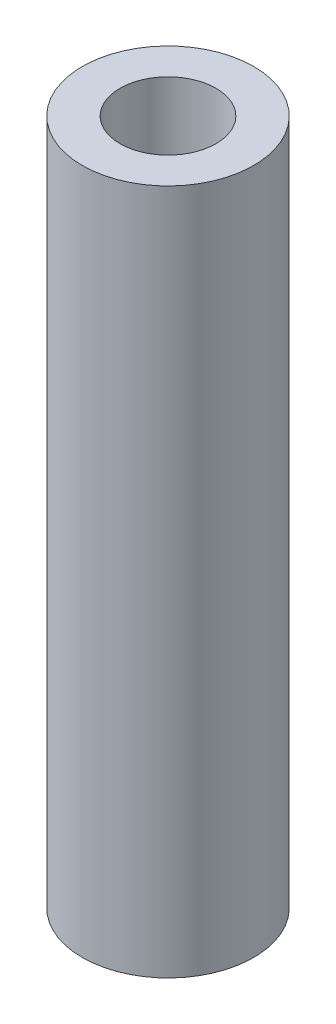
ISO-10303-21;
HEADER;
FILE_DESCRIPTION(('STEP AP214'),'2;1');
FILE_NAME('part.step','',(''),(''),'','','');
FILE_SCHEMA(('AUTOMOTIVE_DESIGN { 1 0 10303 214 1 1 1 1 }'));
ENDSEC;
DATA;
#1=APPLICATION_CONTEXT('core data for automotive mechanical design processes');
#2=APPLICATION_PROTOCOL_DEFINITION('international standard','automotive_design',2000,#1);
#3=PRODUCT_CONTEXT('',#1,'mechanical');
#4=PRODUCT('Part','Part','',(#3));
#5=PRODUCT_RELATED_PRODUCT_CATEGORY('part','',(#4));
#6=PRODUCT_DEFINITION_FORMATION('','',#4);
#7=PRODUCT_DEFINITION_CONTEXT('part definition',#1,'design');
#8=PRODUCT_DEFINITION('design','',#6,#7);
#9=PRODUCT_DEFINITION_SHAPE('','',#8);
#10=(LENGTH_UNIT() NAMED_UNIT(*) SI_UNIT(.MILLI.,.METRE.));
#11=(NAMED_UNIT(*) PLANE_ANGLE_UNIT() SI_UNIT($,.RADIAN.));
#12=(NAMED_UNIT(*) SI_UNIT($,.STERADIAN.) SOLID_ANGLE_UNIT());
#13=UNCERTAINTY_MEASURE_WITH_UNIT(LENGTH_MEASURE(1.E-05),#10,'distance_accuracy_value','');
#14=(GEOMETRIC_REPRESENTATION_CONTEXT(3) GLOBAL_UNCERTAINTY_ASSIGNED_CONTEXT((#13)) GLOBAL_UNIT_ASSIGNED_CONTEXT((#10,
#11,#12)) REPRESENTATION_CONTEXT('',''));
#15=CARTESIAN_POINT('',(0.,0.,0.));
#16=DIRECTION('',(0.,0.,1.));
#17=DIRECTION('',(1.,0.,0.));
#18=AXIS2_PLACEMENT_3D('',#15,#16,#17);
#19=CARTESIAN_POINT('',(0.,20.,0.));
#20=DIRECTION('',(0.,1.,0.));
#21=DIRECTION('',(0.,0.,1.));
#22=AXIS2_PLACEMENT_3D('',#19,#20,#21);
#23=PLANE('',#22);
#24=CARTESIAN_POINT('',(0.,20.,0.));
#25=DIRECTION('',(0.,1.,0.));
#26=DIRECTION('',(0.,0.,1.));
#27=AXIS2_PLACEMENT_3D('',#24,#25,#26);
#28=CIRCLE('',#27,2.5);
#29=CARTESIAN_POINT('',(0.,20.,2.5));
#30=VERTEX_POINT('',#29);
#31=EDGE_CURVE('E10',#30,#30,#28,.T.);
#32=ORIENTED_EDGE('',*,*,#31,.T.);
#33=EDGE_LOOP('',(#32));
#34=FACE_BOUND('',#33,.T.);
#35=CARTESIAN_POINT('',(0.,20.,0.));
#36=DIRECTION('',(0.,1.,0.));
#37=DIRECTION('',(0.,0.,1.));
#38=AXIS2_PLACEMENT_3D('',#35,#36,#37);
#39=CIRCLE('',#38,1.4);
#40=CARTESIAN_POINT('',(0.,20.,1.4));
#41=VERTEX_POINT('',#40);
#42=EDGE_CURVE('E52',#41,#41,#39,.T.);
#43=ORIENTED_EDGE('',*,*,#42,.F.);
#44=EDGE_LOOP('',(#43));
#45=FACE_BOUND('',#44,.T.);
#46=ADVANCED_FACE('F39',(#34,#45),#23,.T.);
#47=CARTESIAN_POINT('',(0.,0.,0.));
#48=DIRECTION('',(0.,1.,0.));
#49=DIRECTION('',(0.,0.,1.));
#50=AXIS2_PLACEMENT_3D('',#47,#48,#49);
#51=PLANE('',#50);
#52=CARTESIAN_POINT('',(0.,0.,0.));
#53=DIRECTION('',(0.,1.,0.));
#54=DIRECTION('',(0.,0.,1.));
#55=AXIS2_PLACEMENT_3D('',#52,#53,#54);
#56=CIRCLE('',#55,2.5);
#57=CARTESIAN_POINT('',(0.,0.,2.5));
#58=VERTEX_POINT('',#57);
#59=EDGE_CURVE('E43',#58,#58,#56,.T.);
#60=ORIENTED_EDGE('',*,*,#59,.F.);
#61=EDGE_LOOP('',(#60));
#62=FACE_BOUND('',#61,.T.);
#63=CARTESIAN_POINT('',(0.,0.,0.));
#64=DIRECTION('',(0.,1.,0.));
#65=DIRECTION('',(0.,0.,1.));
#66=AXIS2_PLACEMENT_3D('',#63,#64,#65);
#67=CIRCLE('',#66,1.4);
#68=CARTESIAN_POINT('',(0.,0.,1.4));
#69=VERTEX_POINT('',#68);
#70=EDGE_CURVE('E54',#69,#69,#67,.T.);
#71=ORIENTED_EDGE('',*,*,#70,.T.);
#72=EDGE_LOOP('',(#71));
#73=FACE_BOUND('',#72,.T.);
#74=ADVANCED_FACE('F66',(#62,#73),#51,.F.);
#75=CARTESIAN_POINT('',(0.,20.,0.));
#76=DIRECTION('',(0.,-1.,0.));
#77=DIRECTION('',(0.,0.,-1.));
#78=AXIS2_PLACEMENT_3D('',#75,#76,#77);
#79=CYLINDRICAL_SURFACE('',#78,2.5);
#80=ORIENTED_EDGE('',*,*,#31,.F.);
#81=EDGE_LOOP('',(#80));
#82=FACE_BOUND('',#81,.T.);
#83=ORIENTED_EDGE('',*,*,#59,.T.);
#84=EDGE_LOOP('',(#83));
#85=FACE_BOUND('',#84,.T.);
#86=ADVANCED_FACE('F41',(#82,#85),#79,.T.);
#87=CARTESIAN_POINT('',(0.,20.,0.));
#88=DIRECTION('',(0.,-1.,0.));
#89=DIRECTION('',(0.,0.,-1.));
#90=AXIS2_PLACEMENT_3D('',#87,#88,#89);
#91=CYLINDRICAL_SURFACE('',#90,1.4);
#92=ORIENTED_EDGE('',*,*,#42,.T.);
#93=EDGE_LOOP('',(#92));
#94=FACE_BOUND('',#93,.T.);
#95=ORIENTED_EDGE('',*,*,#70,.F.);
#96=EDGE_LOOP('',(#95));
#97=FACE_BOUND('',#96,.T.);
#98=ADVANCED_FACE('F62',(#94,#97),#91,.F.);
#99=CLOSED_SHELL('',(#46,#74,#86,#98));
#100=MANIFOLD_SOLID_BREP('B2',#99);
#101=ADVANCED_BREP_SHAPE_REPRESENTATION('',(#18,#100),#14);
#102=SHAPE_DEFINITION_REPRESENTATION(#9,#101);
ENDSEC;
END-ISO-10303-21;
